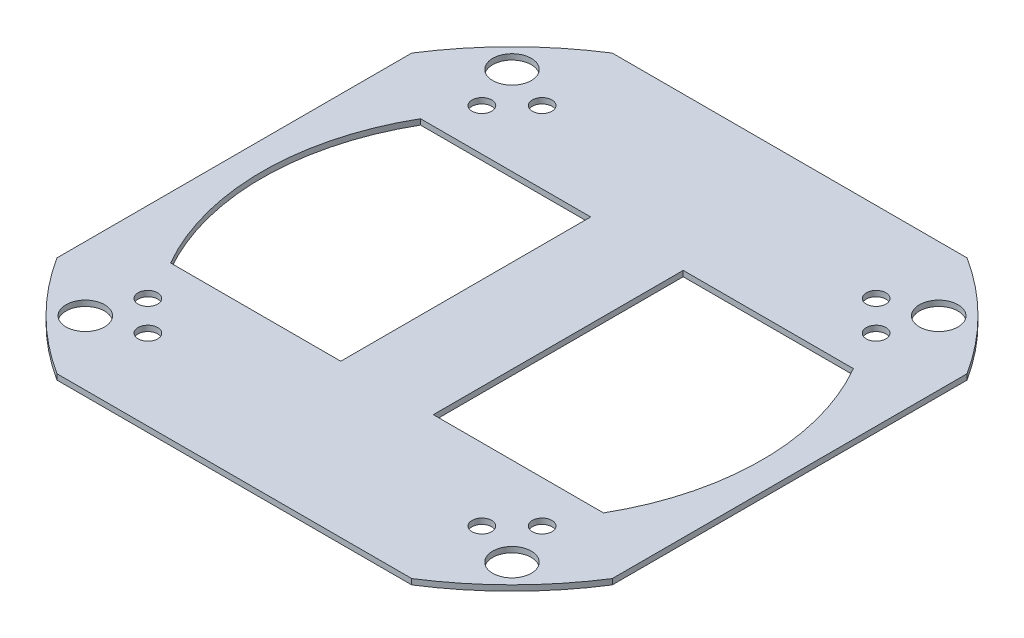
ISO-10303-21;
HEADER;
FILE_DESCRIPTION(('STEP AP214'),'2;1');
FILE_NAME('part.step','',(''),(''),'','','');
FILE_SCHEMA(('AUTOMOTIVE_DESIGN { 1 0 10303 214 1 1 1 1 }'));
ENDSEC;
DATA;
#1=APPLICATION_CONTEXT('core data for automotive mechanical design processes');
#2=APPLICATION_PROTOCOL_DEFINITION('international standard','automotive_design',2000,#1);
#3=PRODUCT_CONTEXT('',#1,'mechanical');
#4=PRODUCT('Part','Part','',(#3));
#5=PRODUCT_RELATED_PRODUCT_CATEGORY('part','',(#4));
#6=PRODUCT_DEFINITION_FORMATION('','',#4);
#7=PRODUCT_DEFINITION_CONTEXT('part definition',#1,'design');
#8=PRODUCT_DEFINITION('design','',#6,#7);
#9=PRODUCT_DEFINITION_SHAPE('','',#8);
#10=(LENGTH_UNIT() NAMED_UNIT(*) SI_UNIT(.MILLI.,.METRE.));
#11=(NAMED_UNIT(*) PLANE_ANGLE_UNIT() SI_UNIT($,.RADIAN.));
#12=(NAMED_UNIT(*) SI_UNIT($,.STERADIAN.) SOLID_ANGLE_UNIT());
#13=UNCERTAINTY_MEASURE_WITH_UNIT(LENGTH_MEASURE(1.E-05),#10,'distance_accuracy_value','');
#14=(GEOMETRIC_REPRESENTATION_CONTEXT(3) GLOBAL_UNCERTAINTY_ASSIGNED_CONTEXT((#13)) GLOBAL_UNIT_ASSIGNED_CONTEXT((#10,
#11,#12)) REPRESENTATION_CONTEXT('',''));
#15=CARTESIAN_POINT('',(0.,0.,0.));
#16=DIRECTION('',(0.,0.,1.));
#17=DIRECTION('',(1.,0.,0.));
#18=AXIS2_PLACEMENT_3D('',#15,#16,#17);
#19=CARTESIAN_POINT('',(0.,3.,0.));
#20=DIRECTION('',(0.,-1.,0.));
#21=DIRECTION('',(0.,0.,-1.));
#22=AXIS2_PLACEMENT_3D('',#19,#20,#21);
#23=CYLINDRICAL_SURFACE('',#22,178.);
#24=CARTESIAN_POINT('',(0.,3.,0.));
#25=DIRECTION('',(0.,1.,0.));
#26=DIRECTION('',(0.,0.,1.));
#27=AXIS2_PLACEMENT_3D('',#24,#25,#26);
#28=CIRCLE('',#27,178.);
#29=CARTESIAN_POINT('',(150.,3.,-95.8331884056875));
#30=VERTEX_POINT('',#29);
#31=CARTESIAN_POINT('',(95.8331884056876,3.,-150.));
#32=VERTEX_POINT('',#31);
#33=EDGE_CURVE('E165',#30,#32,#28,.T.);
#34=ORIENTED_EDGE('',*,*,#33,.F.);
#35=DIRECTION('',(0.,-1.,0.));
#36=VECTOR('',#35,1.);
#37=CARTESIAN_POINT('',(150.,3.,-95.8331884056875));
#38=LINE('',#37,#36);
#39=CARTESIAN_POINT('',(150.,0.,-95.8331884056875));
#40=VERTEX_POINT('',#39);
#41=EDGE_CURVE('E11',#30,#40,#38,.T.);
#42=ORIENTED_EDGE('',*,*,#41,.T.);
#43=CARTESIAN_POINT('',(0.,0.,0.));
#44=DIRECTION('',(0.,1.,0.));
#45=DIRECTION('',(0.,0.,1.));
#46=AXIS2_PLACEMENT_3D('',#43,#44,#45);
#47=CIRCLE('',#46,178.);
#48=CARTESIAN_POINT('',(95.8331884056876,0.,-150.));
#49=VERTEX_POINT('',#48);
#50=EDGE_CURVE('E185',#40,#49,#47,.T.);
#51=ORIENTED_EDGE('',*,*,#50,.T.);
#52=DIRECTION('',(0.,-1.,0.));
#53=VECTOR('',#52,1.);
#54=CARTESIAN_POINT('',(95.8331884056875,3.,-150.));
#55=LINE('',#54,#53);
#56=EDGE_CURVE('E172',#49,#32,#55,.F.);
#57=ORIENTED_EDGE('',*,*,#56,.T.);
#58=EDGE_LOOP('',(#34,#42,#51,#57));
#59=FACE_BOUND('',#58,.T.);
#60=ADVANCED_FACE('F38',(#59),#23,.T.);
#61=CARTESIAN_POINT('',(-95.8331884056876,3.,-150.));
#62=VERTEX_POINT('',#61);
#63=CARTESIAN_POINT('',(-150.,3.,-95.8331884056876));
#64=VERTEX_POINT('',#63);
#65=EDGE_CURVE('E173',#62,#64,#28,.T.);
#66=ORIENTED_EDGE('',*,*,#65,.F.);
#67=DIRECTION('',(0.,-1.,0.));
#68=VECTOR('',#67,1.);
#69=CARTESIAN_POINT('',(-95.8331884056875,3.,-150.));
#70=LINE('',#69,#68);
#71=CARTESIAN_POINT('',(-95.8331884056876,0.,-150.));
#72=VERTEX_POINT('',#71);
#73=EDGE_CURVE('E235',#62,#72,#70,.T.);
#74=ORIENTED_EDGE('',*,*,#73,.T.);
#75=CARTESIAN_POINT('',(-150.,0.,-95.8331884056877));
#76=VERTEX_POINT('',#75);
#77=EDGE_CURVE('E347',#72,#76,#47,.T.);
#78=ORIENTED_EDGE('',*,*,#77,.T.);
#79=DIRECTION('',(0.,-1.,0.));
#80=VECTOR('',#79,1.);
#81=CARTESIAN_POINT('',(-150.,3.,-95.8331884056875));
#82=LINE('',#81,#80);
#83=EDGE_CURVE('E175',#76,#64,#82,.F.);
#84=ORIENTED_EDGE('',*,*,#83,.T.);
#85=EDGE_LOOP('',(#66,#74,#78,#84));
#86=FACE_BOUND('',#85,.T.);
#87=ADVANCED_FACE('F354',(#86),#23,.T.);
#88=CARTESIAN_POINT('',(95.8331884056876,0.,150.));
#89=VERTEX_POINT('',#88);
#90=CARTESIAN_POINT('',(150.,0.,95.8331884056875));
#91=VERTEX_POINT('',#90);
#92=EDGE_CURVE('E182',#89,#91,#47,.T.);
#93=ORIENTED_EDGE('',*,*,#92,.T.);
#94=DIRECTION('',(0.,-1.,0.));
#95=VECTOR('',#94,1.);
#96=CARTESIAN_POINT('',(150.,3.,95.8331884056875));
#97=LINE('',#96,#95);
#98=CARTESIAN_POINT('',(150.,3.,95.8331884056876));
#99=VERTEX_POINT('',#98);
#100=EDGE_CURVE('E46',#91,#99,#97,.F.);
#101=ORIENTED_EDGE('',*,*,#100,.T.);
#102=CARTESIAN_POINT('',(95.8331884056876,3.,150.));
#103=VERTEX_POINT('',#102);
#104=EDGE_CURVE('E167',#103,#99,#28,.T.);
#105=ORIENTED_EDGE('',*,*,#104,.F.);
#106=DIRECTION('',(0.,-1.,0.));
#107=VECTOR('',#106,1.);
#108=CARTESIAN_POINT('',(95.8331884056875,3.,150.));
#109=LINE('',#108,#107);
#110=EDGE_CURVE('E231',#103,#89,#109,.T.);
#111=ORIENTED_EDGE('',*,*,#110,.T.);
#112=EDGE_LOOP('',(#93,#101,#105,#111));
#113=FACE_BOUND('',#112,.T.);
#114=ADVANCED_FACE('F238',(#113),#23,.T.);
#115=CARTESIAN_POINT('',(0.,3.,0.));
#116=DIRECTION('',(0.,1.,0.));
#117=DIRECTION('',(0.,0.,1.));
#118=AXIS2_PLACEMENT_3D('',#115,#116,#117);
#119=PLANE('',#118);
#120=DIRECTION('',(0.,0.,1.));
#121=VECTOR('',#120,1.);
#122=CARTESIAN_POINT('',(150.,3.,-95.8331884056875));
#123=LINE('',#122,#121);
#124=EDGE_CURVE('E151',#30,#99,#123,.T.);
#125=ORIENTED_EDGE('',*,*,#124,.F.);
#126=ORIENTED_EDGE('',*,*,#33,.T.);
#127=DIRECTION('',(1.,0.,0.));
#128=VECTOR('',#127,1.);
#129=CARTESIAN_POINT('',(95.8331884056876,3.,-150.));
#130=LINE('',#129,#128);
#131=EDGE_CURVE('E169',#62,#32,#130,.T.);
#132=ORIENTED_EDGE('',*,*,#131,.F.);
#133=ORIENTED_EDGE('',*,*,#65,.T.);
#134=DIRECTION('',(0.,0.,-1.));
#135=VECTOR('',#134,1.);
#136=CARTESIAN_POINT('',(-150.,3.,0.));
#137=LINE('',#136,#135);
#138=CARTESIAN_POINT('',(-150.,3.,95.8331884056875));
#139=VERTEX_POINT('',#138);
#140=EDGE_CURVE('E61',#139,#64,#137,.T.);
#141=ORIENTED_EDGE('',*,*,#140,.F.);
#142=CARTESIAN_POINT('',(-95.8331884056876,3.,150.));
#143=VERTEX_POINT('',#142);
#144=EDGE_CURVE('E176',#139,#143,#28,.T.);
#145=ORIENTED_EDGE('',*,*,#144,.T.);
#146=DIRECTION('',(-1.,0.,0.));
#147=VECTOR('',#146,1.);
#148=CARTESIAN_POINT('',(0.,3.,150.));
#149=LINE('',#148,#147);
#150=EDGE_CURVE('E53',#103,#143,#149,.T.);
#151=ORIENTED_EDGE('',*,*,#150,.F.);
#152=ORIENTED_EDGE('',*,*,#104,.T.);
#153=EDGE_LOOP('',(#125,#126,#132,#133,#141,#145,#151,#152));
#154=FACE_BOUND('',#153,.T.);
#155=CARTESIAN_POINT('',(90.2169257844611,3.,-106.480381751763));
#156=DIRECTION('',(0.,1.,0.));
#157=DIRECTION('',(0.,0.,1.));
#158=AXIS2_PLACEMENT_3D('',#155,#156,#157);
#159=CIRCLE('',#158,5.30000000000001);
#160=CARTESIAN_POINT('',(90.2169257844611,3.,-101.180381751763));
#161=VERTEX_POINT('',#160);
#162=EDGE_CURVE('E258',#161,#161,#159,.T.);
#163=ORIENTED_EDGE('',*,*,#162,.F.);
#164=EDGE_LOOP('',(#163));
#165=FACE_BOUND('',#164,.T.);
#166=CARTESIAN_POINT('',(-90.216925784473,3.,-106.480381751751));
#167=DIRECTION('',(0.,1.,0.));
#168=DIRECTION('',(0.,0.,-1.));
#169=AXIS2_PLACEMENT_3D('',#166,#167,#168);
#170=CIRCLE('',#169,5.30000000000001);
#171=CARTESIAN_POINT('',(-90.216925784473,3.,-111.780381751751));
#172=VERTEX_POINT('',#171);
#173=EDGE_CURVE('E268',#172,#172,#170,.T.);
#174=ORIENTED_EDGE('',*,*,#173,.F.);
#175=EDGE_LOOP('',(#174));
#176=FACE_BOUND('',#175,.T.);
#177=CARTESIAN_POINT('',(-106.480381751764,3.,-90.2169257844607));
#178=DIRECTION('',(0.,1.,0.));
#179=DIRECTION('',(0.,0.,1.));
#180=AXIS2_PLACEMENT_3D('',#177,#178,#179);
#181=CIRCLE('',#180,5.30000000000001);
#182=CARTESIAN_POINT('',(-106.480381751764,3.,-84.9169257844607));
#183=VERTEX_POINT('',#182);
#184=EDGE_CURVE('E265',#183,#183,#181,.T.);
#185=ORIENTED_EDGE('',*,*,#184,.F.);
#186=EDGE_LOOP('',(#185));
#187=FACE_BOUND('',#186,.T.);
#188=CARTESIAN_POINT('',(-106.480381751751,3.,90.2169257844734));
#189=DIRECTION('',(0.,1.,0.));
#190=DIRECTION('',(0.,0.,-1.));
#191=AXIS2_PLACEMENT_3D('',#188,#189,#190);
#192=CIRCLE('',#191,5.30000000000001);
#193=CARTESIAN_POINT('',(-106.480381751751,3.,84.9169257844734));
#194=VERTEX_POINT('',#193);
#195=EDGE_CURVE('E261',#194,#194,#192,.T.);
#196=ORIENTED_EDGE('',*,*,#195,.F.);
#197=EDGE_LOOP('',(#196));
#198=FACE_BOUND('',#197,.T.);
#199=CARTESIAN_POINT('',(115.258405333413,3.,115.258405333407));
#200=DIRECTION('',(0.,1.,0.));
#201=DIRECTION('',(0.,0.,1.));
#202=AXIS2_PLACEMENT_3D('',#199,#200,#201);
#203=CIRCLE('',#202,10.4140000000044);
#204=CARTESIAN_POINT('',(115.258405333413,3.,125.672405333412));
#205=VERTEX_POINT('',#204);
#206=EDGE_CURVE('E279',#205,#205,#203,.T.);
#207=ORIENTED_EDGE('',*,*,#206,.F.);
#208=EDGE_LOOP('',(#207));
#209=FACE_BOUND('',#208,.T.);
#210=CARTESIAN_POINT('',(-115.258405333401,3.,115.258405333413));
#211=DIRECTION('',(0.,1.,0.));
#212=DIRECTION('',(0.,0.,1.));
#213=AXIS2_PLACEMENT_3D('',#210,#211,#212);
#214=CIRCLE('',#213,10.4140000000044);
#215=CARTESIAN_POINT('',(-115.258405333401,3.,125.672405333418));
#216=VERTEX_POINT('',#215);
#217=EDGE_CURVE('E276',#216,#216,#214,.T.);
#218=ORIENTED_EDGE('',*,*,#217,.F.);
#219=EDGE_LOOP('',(#218));
#220=FACE_BOUND('',#219,.T.);
#221=CARTESIAN_POINT('',(-115.258405333407,3.,-115.258405333401));
#222=DIRECTION('',(0.,1.,0.));
#223=DIRECTION('',(0.,0.,1.));
#224=AXIS2_PLACEMENT_3D('',#221,#222,#223);
#225=CIRCLE('',#224,10.4140000000044);
#226=CARTESIAN_POINT('',(-115.258405333407,3.,-104.844405333397));
#227=VERTEX_POINT('',#226);
#228=EDGE_CURVE('E273',#227,#227,#225,.T.);
#229=ORIENTED_EDGE('',*,*,#228,.F.);
#230=EDGE_LOOP('',(#229));
#231=FACE_BOUND('',#230,.T.);
#232=CARTESIAN_POINT('',(-90.2169257844604,3.,106.480381751764));
#233=DIRECTION('',(0.,1.,0.));
#234=DIRECTION('',(0.,0.,1.));
#235=AXIS2_PLACEMENT_3D('',#232,#233,#234);
#236=CIRCLE('',#235,5.3);
#237=CARTESIAN_POINT('',(-90.2169257844604,3.,111.780381751764));
#238=VERTEX_POINT('',#237);
#239=EDGE_CURVE('E264',#238,#238,#236,.T.);
#240=ORIENTED_EDGE('',*,*,#239,.F.);
#241=EDGE_LOOP('',(#240));
#242=FACE_BOUND('',#241,.T.);
#243=CARTESIAN_POINT('',(106.480381751752,3.,-90.2169257844727));
#244=DIRECTION('',(0.,1.,0.));
#245=DIRECTION('',(0.,0.,-1.));
#246=AXIS2_PLACEMENT_3D('',#243,#244,#245);
#247=CIRCLE('',#246,5.30000000000001);
#248=CARTESIAN_POINT('',(106.480381751752,3.,-95.5169257844727));
#249=VERTEX_POINT('',#248);
#250=EDGE_CURVE('E255',#249,#249,#247,.T.);
#251=ORIENTED_EDGE('',*,*,#250,.F.);
#252=EDGE_LOOP('',(#251));
#253=FACE_BOUND('',#252,.T.);
#254=CARTESIAN_POINT('',(106.480381751763,3.,90.2169257844615));
#255=DIRECTION('',(0.,1.,0.));
#256=DIRECTION('',(0.,0.,1.));
#257=AXIS2_PLACEMENT_3D('',#254,#255,#256);
#258=CIRCLE('',#257,5.3);
#259=CARTESIAN_POINT('',(106.480381751763,3.,95.5169257844615));
#260=VERTEX_POINT('',#259);
#261=EDGE_CURVE('E249',#260,#260,#258,.T.);
#262=ORIENTED_EDGE('',*,*,#261,.F.);
#263=EDGE_LOOP('',(#262));
#264=FACE_BOUND('',#263,.T.);
#265=CARTESIAN_POINT('',(90.2169257844723,3.,106.480381751752));
#266=DIRECTION('',(0.,1.,0.));
#267=DIRECTION('',(0.,0.,-1.));
#268=AXIS2_PLACEMENT_3D('',#265,#266,#267);
#269=CIRCLE('',#268,5.30000000000002);
#270=CARTESIAN_POINT('',(90.2169257844723,3.,101.180381751752));
#271=VERTEX_POINT('',#270);
#272=EDGE_CURVE('E245',#271,#271,#269,.T.);
#273=ORIENTED_EDGE('',*,*,#272,.F.);
#274=EDGE_LOOP('',(#273));
#275=FACE_BOUND('',#274,.T.);
#276=CARTESIAN_POINT('',(115.258405333407,3.,-115.258405333407));
#277=DIRECTION('',(0.,1.,0.));
#278=DIRECTION('',(0.,0.,1.));
#279=AXIS2_PLACEMENT_3D('',#276,#277,#278);
#280=CIRCLE('',#279,10.4140000000044);
#281=CARTESIAN_POINT('',(115.258405333407,3.,-104.844405333403));
#282=VERTEX_POINT('',#281);
#283=EDGE_CURVE('E191',#282,#282,#280,.T.);
#284=ORIENTED_EDGE('',*,*,#283,.F.);
#285=EDGE_LOOP('',(#284));
#286=FACE_BOUND('',#285,.T.);
#287=CARTESIAN_POINT('',(0.,3.,0.));
#288=DIRECTION('',(0.,1.,0.));
#289=DIRECTION('',(0.,0.,1.));
#290=AXIS2_PLACEMENT_3D('',#287,#288,#289);
#291=CIRCLE('',#290,135.);
#292=CARTESIAN_POINT('',(-116.913429510899,3.,-67.5000000000001));
#293=VERTEX_POINT('',#292);
#294=CARTESIAN_POINT('',(-116.913429510899,3.,67.5));
#295=VERTEX_POINT('',#294);
#296=EDGE_CURVE('E320',#293,#295,#291,.T.);
#297=ORIENTED_EDGE('',*,*,#296,.F.);
#298=DIRECTION('',(-1.,0.,0.));
#299=VECTOR('',#298,1.);
#300=CARTESIAN_POINT('',(-25.,3.,-67.5));
#301=LINE('',#300,#299);
#302=CARTESIAN_POINT('',(-25.,3.,-67.5));
#303=VERTEX_POINT('',#302);
#304=EDGE_CURVE('E317',#303,#293,#301,.T.);
#305=ORIENTED_EDGE('',*,*,#304,.F.);
#306=DIRECTION('',(0.,0.,-1.));
#307=VECTOR('',#306,1.);
#308=CARTESIAN_POINT('',(-25.,3.,-33.75));
#309=LINE('',#308,#307);
#310=CARTESIAN_POINT('',(-25.,3.,67.5));
#311=VERTEX_POINT('',#310);
#312=EDGE_CURVE('E315',#311,#303,#309,.T.);
#313=ORIENTED_EDGE('',*,*,#312,.F.);
#314=DIRECTION('',(1.,0.,0.));
#315=VECTOR('',#314,1.);
#316=CARTESIAN_POINT('',(-25.,3.,67.5));
#317=LINE('',#316,#315);
#318=EDGE_CURVE('E322',#295,#311,#317,.T.);
#319=ORIENTED_EDGE('',*,*,#318,.F.);
#320=EDGE_LOOP('',(#297,#305,#313,#319));
#321=FACE_BOUND('',#320,.T.);
#322=CARTESIAN_POINT('',(0.,3.,0.));
#323=DIRECTION('',(0.,1.,0.));
#324=DIRECTION('',(0.,0.,1.));
#325=AXIS2_PLACEMENT_3D('',#322,#323,#324);
#326=CIRCLE('',#325,135.);
#327=CARTESIAN_POINT('',(116.913429510899,3.,67.5));
#328=VERTEX_POINT('',#327);
#329=CARTESIAN_POINT('',(116.913429510899,3.,-67.5));
#330=VERTEX_POINT('',#329);
#331=EDGE_CURVE('E291',#328,#330,#326,.T.);
#332=ORIENTED_EDGE('',*,*,#331,.F.);
#333=DIRECTION('',(1.,0.,0.));
#334=VECTOR('',#333,1.);
#335=CARTESIAN_POINT('',(25.,3.,67.5));
#336=LINE('',#335,#334);
#337=CARTESIAN_POINT('',(25.,3.,67.5));
#338=VERTEX_POINT('',#337);
#339=EDGE_CURVE('E288',#338,#328,#336,.T.);
#340=ORIENTED_EDGE('',*,*,#339,.F.);
#341=DIRECTION('',(0.,0.,1.));
#342=VECTOR('',#341,1.);
#343=CARTESIAN_POINT('',(25.,3.,-33.75));
#344=LINE('',#343,#342);
#345=CARTESIAN_POINT('',(25.,3.,-67.5));
#346=VERTEX_POINT('',#345);
#347=EDGE_CURVE('E286',#346,#338,#344,.T.);
#348=ORIENTED_EDGE('',*,*,#347,.F.);
#349=DIRECTION('',(-1.,0.,0.));
#350=VECTOR('',#349,1.);
#351=CARTESIAN_POINT('',(25.,3.,-67.5));
#352=LINE('',#351,#350);
#353=EDGE_CURVE('E293',#330,#346,#352,.T.);
#354=ORIENTED_EDGE('',*,*,#353,.F.);
#355=EDGE_LOOP('',(#332,#340,#348,#354));
#356=FACE_BOUND('',#355,.T.);
#357=ADVANCED_FACE('F162',(#154,#165,#176,#187,#198,#209,#220,#231,#242,#253,#264,#275,#286,
#321,#356),#119,.T.);
#358=CARTESIAN_POINT('',(0.,0.,0.));
#359=DIRECTION('',(0.,1.,0.));
#360=DIRECTION('',(0.,0.,1.));
#361=AXIS2_PLACEMENT_3D('',#358,#359,#360);
#362=PLANE('',#361);
#363=CARTESIAN_POINT('',(90.2169257844611,0.,-106.480381751763));
#364=DIRECTION('',(0.,1.,0.));
#365=DIRECTION('',(0.,0.,1.));
#366=AXIS2_PLACEMENT_3D('',#363,#364,#365);
#367=CIRCLE('',#366,5.30000000000001);
#368=CARTESIAN_POINT('',(90.2169257844611,0.,-101.180381751763));
#369=VERTEX_POINT('',#368);
#370=EDGE_CURVE('E221',#369,#369,#367,.T.);
#371=ORIENTED_EDGE('',*,*,#370,.T.);
#372=EDGE_LOOP('',(#371));
#373=FACE_BOUND('',#372,.T.);
#374=CARTESIAN_POINT('',(-90.216925784473,0.,-106.480381751751));
#375=DIRECTION('',(0.,1.,0.));
#376=DIRECTION('',(0.,0.,1.));
#377=AXIS2_PLACEMENT_3D('',#374,#375,#376);
#378=CIRCLE('',#377,5.30000000000001);
#379=CARTESIAN_POINT('',(-90.216925784473,0.,-101.180381751751));
#380=VERTEX_POINT('',#379);
#381=EDGE_CURVE('E218',#380,#380,#378,.T.);
#382=ORIENTED_EDGE('',*,*,#381,.T.);
#383=EDGE_LOOP('',(#382));
#384=FACE_BOUND('',#383,.T.);
#385=CARTESIAN_POINT('',(-106.480381751764,0.,-90.2169257844607));
#386=DIRECTION('',(0.,1.,0.));
#387=DIRECTION('',(0.,0.,1.));
#388=AXIS2_PLACEMENT_3D('',#385,#386,#387);
#389=CIRCLE('',#388,5.30000000000001);
#390=CARTESIAN_POINT('',(-106.480381751764,0.,-84.9169257844607));
#391=VERTEX_POINT('',#390);
#392=EDGE_CURVE('E215',#391,#391,#389,.T.);
#393=ORIENTED_EDGE('',*,*,#392,.T.);
#394=EDGE_LOOP('',(#393));
#395=FACE_BOUND('',#394,.T.);
#396=CARTESIAN_POINT('',(-106.480381751751,0.,90.2169257844734));
#397=DIRECTION('',(0.,1.,0.));
#398=DIRECTION('',(0.,0.,1.));
#399=AXIS2_PLACEMENT_3D('',#396,#397,#398);
#400=CIRCLE('',#399,5.30000000000001);
#401=CARTESIAN_POINT('',(-106.480381751751,0.,95.5169257844734));
#402=VERTEX_POINT('',#401);
#403=EDGE_CURVE('E212',#402,#402,#400,.T.);
#404=ORIENTED_EDGE('',*,*,#403,.T.);
#405=EDGE_LOOP('',(#404));
#406=FACE_BOUND('',#405,.T.);
#407=CARTESIAN_POINT('',(115.258405333413,0.,115.258405333407));
#408=DIRECTION('',(0.,1.,0.));
#409=DIRECTION('',(0.,0.,1.));
#410=AXIS2_PLACEMENT_3D('',#407,#408,#409);
#411=CIRCLE('',#410,10.4140000000044);
#412=CARTESIAN_POINT('',(115.258405333413,0.,125.672405333412));
#413=VERTEX_POINT('',#412);
#414=EDGE_CURVE('E209',#413,#413,#411,.T.);
#415=ORIENTED_EDGE('',*,*,#414,.T.);
#416=EDGE_LOOP('',(#415));
#417=FACE_BOUND('',#416,.T.);
#418=CARTESIAN_POINT('',(-115.258405333401,0.,115.258405333413));
#419=DIRECTION('',(0.,1.,0.));
#420=DIRECTION('',(0.,0.,1.));
#421=AXIS2_PLACEMENT_3D('',#418,#419,#420);
#422=CIRCLE('',#421,10.4140000000044);
#423=CARTESIAN_POINT('',(-115.258405333401,0.,125.672405333418));
#424=VERTEX_POINT('',#423);
#425=EDGE_CURVE('E206',#424,#424,#422,.T.);
#426=ORIENTED_EDGE('',*,*,#425,.T.);
#427=EDGE_LOOP('',(#426));
#428=FACE_BOUND('',#427,.T.);
#429=CARTESIAN_POINT('',(-115.258405333407,0.,-115.258405333401));
#430=DIRECTION('',(0.,1.,0.));
#431=DIRECTION('',(0.,0.,1.));
#432=AXIS2_PLACEMENT_3D('',#429,#430,#431);
#433=CIRCLE('',#432,10.4140000000044);
#434=CARTESIAN_POINT('',(-115.258405333407,0.,-104.844405333397));
#435=VERTEX_POINT('',#434);
#436=EDGE_CURVE('E203',#435,#435,#433,.T.);
#437=ORIENTED_EDGE('',*,*,#436,.T.);
#438=EDGE_LOOP('',(#437));
#439=FACE_BOUND('',#438,.T.);
#440=CARTESIAN_POINT('',(-90.2169257844604,0.,106.480381751764));
#441=DIRECTION('',(0.,1.,0.));
#442=DIRECTION('',(0.,0.,1.));
#443=AXIS2_PLACEMENT_3D('',#440,#441,#442);
#444=CIRCLE('',#443,5.3);
#445=CARTESIAN_POINT('',(-90.2169257844604,0.,111.780381751764));
#446=VERTEX_POINT('',#445);
#447=EDGE_CURVE('E200',#446,#446,#444,.T.);
#448=ORIENTED_EDGE('',*,*,#447,.T.);
#449=EDGE_LOOP('',(#448));
#450=FACE_BOUND('',#449,.T.);
#451=CARTESIAN_POINT('',(106.480381751752,0.,-90.2169257844727));
#452=DIRECTION('',(0.,1.,0.));
#453=DIRECTION('',(0.,0.,1.));
#454=AXIS2_PLACEMENT_3D('',#451,#452,#453);
#455=CIRCLE('',#454,5.30000000000001);
#456=CARTESIAN_POINT('',(106.480381751752,0.,-84.9169257844726));
#457=VERTEX_POINT('',#456);
#458=EDGE_CURVE('E197',#457,#457,#455,.T.);
#459=ORIENTED_EDGE('',*,*,#458,.T.);
#460=EDGE_LOOP('',(#459));
#461=FACE_BOUND('',#460,.T.);
#462=CARTESIAN_POINT('',(106.480381751763,0.,90.2169257844615));
#463=DIRECTION('',(0.,1.,0.));
#464=DIRECTION('',(0.,0.,1.));
#465=AXIS2_PLACEMENT_3D('',#462,#463,#464);
#466=CIRCLE('',#465,5.3);
#467=CARTESIAN_POINT('',(106.480381751763,0.,95.5169257844615));
#468=VERTEX_POINT('',#467);
#469=EDGE_CURVE('E194',#468,#468,#466,.T.);
#470=ORIENTED_EDGE('',*,*,#469,.T.);
#471=EDGE_LOOP('',(#470));
#472=FACE_BOUND('',#471,.T.);
#473=CARTESIAN_POINT('',(90.2169257844723,0.,106.480381751752));
#474=DIRECTION('',(0.,1.,0.));
#475=DIRECTION('',(0.,0.,1.));
#476=AXIS2_PLACEMENT_3D('',#473,#474,#475);
#477=CIRCLE('',#476,5.30000000000002);
#478=CARTESIAN_POINT('',(90.2169257844723,0.,111.780381751752));
#479=VERTEX_POINT('',#478);
#480=EDGE_CURVE('E190',#479,#479,#477,.T.);
#481=ORIENTED_EDGE('',*,*,#480,.T.);
#482=EDGE_LOOP('',(#481));
#483=FACE_BOUND('',#482,.T.);
#484=CARTESIAN_POINT('',(115.258405333407,0.,-115.258405333407));
#485=DIRECTION('',(0.,1.,0.));
#486=DIRECTION('',(0.,0.,1.));
#487=AXIS2_PLACEMENT_3D('',#484,#485,#486);
#488=CIRCLE('',#487,10.4140000000044);
#489=CARTESIAN_POINT('',(115.258405333407,0.,-104.844405333403));
#490=VERTEX_POINT('',#489);
#491=EDGE_CURVE('E187',#490,#490,#488,.T.);
#492=ORIENTED_EDGE('',*,*,#491,.T.);
#493=EDGE_LOOP('',(#492));
#494=FACE_BOUND('',#493,.T.);
#495=DIRECTION('',(-1.,0.,0.));
#496=VECTOR('',#495,1.);
#497=CARTESIAN_POINT('',(-25.,0.,-67.5));
#498=LINE('',#497,#496);
#499=CARTESIAN_POINT('',(-25.,0.,-67.5));
#500=VERTEX_POINT('',#499);
#501=CARTESIAN_POINT('',(-116.913429510899,0.,-67.5000000000001));
#502=VERTEX_POINT('',#501);
#503=EDGE_CURVE('E314',#500,#502,#498,.T.);
#504=ORIENTED_EDGE('',*,*,#503,.T.);
#505=CARTESIAN_POINT('',(0.,0.,0.));
#506=DIRECTION('',(0.,1.,0.));
#507=DIRECTION('',(0.,0.,1.));
#508=AXIS2_PLACEMENT_3D('',#505,#506,#507);
#509=CIRCLE('',#508,135.);
#510=CARTESIAN_POINT('',(-116.913429510899,0.,67.5));
#511=VERTEX_POINT('',#510);
#512=EDGE_CURVE('E328',#502,#511,#509,.T.);
#513=ORIENTED_EDGE('',*,*,#512,.T.);
#514=DIRECTION('',(1.,0.,0.));
#515=VECTOR('',#514,1.);
#516=CARTESIAN_POINT('',(-25.,0.,67.5));
#517=LINE('',#516,#515);
#518=CARTESIAN_POINT('',(-25.,0.,67.5));
#519=VERTEX_POINT('',#518);
#520=EDGE_CURVE('E331',#511,#519,#517,.T.);
#521=ORIENTED_EDGE('',*,*,#520,.T.);
#522=DIRECTION('',(0.,0.,-1.));
#523=VECTOR('',#522,1.);
#524=CARTESIAN_POINT('',(-25.,0.,-33.75));
#525=LINE('',#524,#523);
#526=EDGE_CURVE('E318',#519,#500,#525,.T.);
#527=ORIENTED_EDGE('',*,*,#526,.T.);
#528=EDGE_LOOP('',(#504,#513,#521,#527));
#529=FACE_BOUND('',#528,.T.);
#530=ORIENTED_EDGE('',*,*,#50,.F.);
#531=DIRECTION('',(0.,0.,1.));
#532=VECTOR('',#531,1.);
#533=CARTESIAN_POINT('',(150.,0.,0.));
#534=LINE('',#533,#532);
#535=EDGE_CURVE('E154',#40,#91,#534,.T.);
#536=ORIENTED_EDGE('',*,*,#535,.T.);
#537=ORIENTED_EDGE('',*,*,#92,.F.);
#538=DIRECTION('',(-1.,0.,0.));
#539=VECTOR('',#538,1.);
#540=CARTESIAN_POINT('',(0.,0.,150.));
#541=LINE('',#540,#539);
#542=CARTESIAN_POINT('',(-95.8331884056876,0.,150.));
#543=VERTEX_POINT('',#542);
#544=EDGE_CURVE('E251',#89,#543,#541,.T.);
#545=ORIENTED_EDGE('',*,*,#544,.T.);
#546=CARTESIAN_POINT('',(-150.,0.,95.8331884056875));
#547=VERTEX_POINT('',#546);
#548=EDGE_CURVE('E186',#547,#543,#47,.T.);
#549=ORIENTED_EDGE('',*,*,#548,.F.);
#550=DIRECTION('',(0.,0.,-1.));
#551=VECTOR('',#550,1.);
#552=CARTESIAN_POINT('',(-150.,0.,0.));
#553=LINE('',#552,#551);
#554=EDGE_CURVE('E168',#547,#76,#553,.T.);
#555=ORIENTED_EDGE('',*,*,#554,.T.);
#556=ORIENTED_EDGE('',*,*,#77,.F.);
#557=DIRECTION('',(1.,0.,0.));
#558=VECTOR('',#557,1.);
#559=CARTESIAN_POINT('',(0.,0.,-150.));
#560=LINE('',#559,#558);
#561=EDGE_CURVE('E246',#72,#49,#560,.T.);
#562=ORIENTED_EDGE('',*,*,#561,.T.);
#563=EDGE_LOOP('',(#530,#536,#537,#545,#549,#555,#556,#562));
#564=FACE_BOUND('',#563,.T.);
#565=DIRECTION('',(1.,0.,0.));
#566=VECTOR('',#565,1.);
#567=CARTESIAN_POINT('',(25.,0.,67.5));
#568=LINE('',#567,#566);
#569=CARTESIAN_POINT('',(25.,0.,67.5));
#570=VERTEX_POINT('',#569);
#571=CARTESIAN_POINT('',(116.913429510899,0.,67.5));
#572=VERTEX_POINT('',#571);
#573=EDGE_CURVE('E224',#570,#572,#568,.T.);
#574=ORIENTED_EDGE('',*,*,#573,.T.);
#575=CARTESIAN_POINT('',(0.,0.,0.));
#576=DIRECTION('',(0.,1.,0.));
#577=DIRECTION('',(0.,0.,1.));
#578=AXIS2_PLACEMENT_3D('',#575,#576,#577);
#579=CIRCLE('',#578,135.);
#580=CARTESIAN_POINT('',(116.913429510899,0.,-67.5));
#581=VERTEX_POINT('',#580);
#582=EDGE_CURVE('E299',#572,#581,#579,.T.);
#583=ORIENTED_EDGE('',*,*,#582,.T.);
#584=DIRECTION('',(-1.,0.,0.));
#585=VECTOR('',#584,1.);
#586=CARTESIAN_POINT('',(25.,0.,-67.5));
#587=LINE('',#586,#585);
#588=CARTESIAN_POINT('',(25.,0.,-67.5));
#589=VERTEX_POINT('',#588);
#590=EDGE_CURVE('E302',#581,#589,#587,.T.);
#591=ORIENTED_EDGE('',*,*,#590,.T.);
#592=DIRECTION('',(0.,0.,1.));
#593=VECTOR('',#592,1.);
#594=CARTESIAN_POINT('',(25.,0.,-33.75));
#595=LINE('',#594,#593);
#596=EDGE_CURVE('E289',#589,#570,#595,.T.);
#597=ORIENTED_EDGE('',*,*,#596,.T.);
#598=EDGE_LOOP('',(#574,#583,#591,#597));
#599=FACE_BOUND('',#598,.T.);
#600=ADVANCED_FACE('F241',(#373,#384,#395,#406,#417,#428,#439,#450,#461,#472,#483,#494,#529,
#564,#599),#362,.F.);
#601=ORIENTED_EDGE('',*,*,#548,.T.);
#602=DIRECTION('',(0.,-1.,0.));
#603=VECTOR('',#602,1.);
#604=CARTESIAN_POINT('',(-95.8331884056875,3.,150.));
#605=LINE('',#604,#603);
#606=EDGE_CURVE('E229',#543,#143,#605,.F.);
#607=ORIENTED_EDGE('',*,*,#606,.T.);
#608=ORIENTED_EDGE('',*,*,#144,.F.);
#609=DIRECTION('',(0.,-1.,0.));
#610=VECTOR('',#609,1.);
#611=CARTESIAN_POINT('',(-150.,3.,95.8331884056875));
#612=LINE('',#611,#610);
#613=EDGE_CURVE('E226',#139,#547,#612,.T.);
#614=ORIENTED_EDGE('',*,*,#613,.T.);
#615=EDGE_LOOP('',(#601,#607,#608,#614));
#616=FACE_BOUND('',#615,.T.);
#617=ADVANCED_FACE('F40',(#616),#23,.T.);
#618=CARTESIAN_POINT('',(-25.,3.,-67.5));
#619=DIRECTION('',(0.,0.,1.));
#620=DIRECTION('',(1.,0.,0.));
#621=AXIS2_PLACEMENT_3D('',#618,#619,#620);
#622=PLANE('',#621);
#623=ORIENTED_EDGE('',*,*,#503,.F.);
#624=DIRECTION('',(0.,-1.,0.));
#625=VECTOR('',#624,1.);
#626=CARTESIAN_POINT('',(-25.,3.,-67.5));
#627=LINE('',#626,#625);
#628=EDGE_CURVE('E180',#303,#500,#627,.T.);
#629=ORIENTED_EDGE('',*,*,#628,.F.);
#630=ORIENTED_EDGE('',*,*,#304,.T.);
#631=DIRECTION('',(0.,-1.,0.));
#632=VECTOR('',#631,1.);
#633=CARTESIAN_POINT('',(-116.913429510899,3.,-67.5000000000001));
#634=LINE('',#633,#632);
#635=EDGE_CURVE('E338',#293,#502,#634,.T.);
#636=ORIENTED_EDGE('',*,*,#635,.T.);
#637=EDGE_LOOP('',(#623,#629,#630,#636));
#638=FACE_BOUND('',#637,.T.);
#639=ADVANCED_FACE('F380',(#638),#622,.T.);
#640=CARTESIAN_POINT('',(0.,3.,0.));
#641=DIRECTION('',(0.,-1.,0.));
#642=DIRECTION('',(0.,0.,-1.));
#643=AXIS2_PLACEMENT_3D('',#640,#641,#642);
#644=CYLINDRICAL_SURFACE('',#643,135.);
#645=ORIENTED_EDGE('',*,*,#512,.F.);
#646=ORIENTED_EDGE('',*,*,#635,.F.);
#647=ORIENTED_EDGE('',*,*,#296,.T.);
#648=DIRECTION('',(0.,-1.,0.));
#649=VECTOR('',#648,1.);
#650=CARTESIAN_POINT('',(-116.913429510899,3.,67.5));
#651=LINE('',#650,#649);
#652=EDGE_CURVE('E337',#295,#511,#651,.T.);
#653=ORIENTED_EDGE('',*,*,#652,.T.);
#654=EDGE_LOOP('',(#645,#646,#647,#653));
#655=FACE_BOUND('',#654,.T.);
#656=ADVANCED_FACE('F385',(#655),#644,.F.);
#657=CARTESIAN_POINT('',(-25.,3.,67.5));
#658=DIRECTION('',(0.,0.,-1.));
#659=DIRECTION('',(-1.,0.,0.));
#660=AXIS2_PLACEMENT_3D('',#657,#658,#659);
#661=PLANE('',#660);
#662=ORIENTED_EDGE('',*,*,#520,.F.);
#663=ORIENTED_EDGE('',*,*,#652,.F.);
#664=ORIENTED_EDGE('',*,*,#318,.T.);
#665=DIRECTION('',(0.,-1.,0.));
#666=VECTOR('',#665,1.);
#667=CARTESIAN_POINT('',(-25.,3.,67.5));
#668=LINE('',#667,#666);
#669=EDGE_CURVE('E325',#311,#519,#668,.T.);
#670=ORIENTED_EDGE('',*,*,#669,.T.);
#671=EDGE_LOOP('',(#662,#663,#664,#670));
#672=FACE_BOUND('',#671,.T.);
#673=ADVANCED_FACE('F398',(#672),#661,.T.);
#674=CARTESIAN_POINT('',(-25.,3.,-33.75));
#675=DIRECTION('',(-1.,0.,0.));
#676=DIRECTION('',(0.,0.,1.));
#677=AXIS2_PLACEMENT_3D('',#674,#675,#676);
#678=PLANE('',#677);
#679=ORIENTED_EDGE('',*,*,#526,.F.);
#680=ORIENTED_EDGE('',*,*,#669,.F.);
#681=ORIENTED_EDGE('',*,*,#312,.T.);
#682=ORIENTED_EDGE('',*,*,#628,.T.);
#683=EDGE_LOOP('',(#679,#680,#681,#682));
#684=FACE_BOUND('',#683,.T.);
#685=ADVANCED_FACE('F402',(#684),#678,.T.);
#686=CARTESIAN_POINT('',(25.,3.,67.5));
#687=DIRECTION('',(0.,0.,-1.));
#688=DIRECTION('',(-1.,0.,0.));
#689=AXIS2_PLACEMENT_3D('',#686,#687,#688);
#690=PLANE('',#689);
#691=ORIENTED_EDGE('',*,*,#573,.F.);
#692=DIRECTION('',(0.,-1.,0.));
#693=VECTOR('',#692,1.);
#694=CARTESIAN_POINT('',(25.,3.,67.5));
#695=LINE('',#694,#693);
#696=EDGE_CURVE('E312',#338,#570,#695,.T.);
#697=ORIENTED_EDGE('',*,*,#696,.F.);
#698=ORIENTED_EDGE('',*,*,#339,.T.);
#699=DIRECTION('',(0.,-1.,0.));
#700=VECTOR('',#699,1.);
#701=CARTESIAN_POINT('',(116.913429510899,3.,67.5));
#702=LINE('',#701,#700);
#703=EDGE_CURVE('E310',#328,#572,#702,.T.);
#704=ORIENTED_EDGE('',*,*,#703,.T.);
#705=EDGE_LOOP('',(#691,#697,#698,#704));
#706=FACE_BOUND('',#705,.T.);
#707=ADVANCED_FACE('F406',(#706),#690,.T.);
#708=CARTESIAN_POINT('',(0.,3.,0.));
#709=DIRECTION('',(0.,-1.,0.));
#710=DIRECTION('',(0.,0.,-1.));
#711=AXIS2_PLACEMENT_3D('',#708,#709,#710);
#712=CYLINDRICAL_SURFACE('',#711,135.);
#713=ORIENTED_EDGE('',*,*,#582,.F.);
#714=ORIENTED_EDGE('',*,*,#703,.F.);
#715=ORIENTED_EDGE('',*,*,#331,.T.);
#716=DIRECTION('',(0.,-1.,0.));
#717=VECTOR('',#716,1.);
#718=CARTESIAN_POINT('',(116.913429510899,3.,-67.5));
#719=LINE('',#718,#717);
#720=EDGE_CURVE('E308',#330,#581,#719,.T.);
#721=ORIENTED_EDGE('',*,*,#720,.T.);
#722=EDGE_LOOP('',(#713,#714,#715,#721));
#723=FACE_BOUND('',#722,.T.);
#724=ADVANCED_FACE('F409',(#723),#712,.F.);
#725=CARTESIAN_POINT('',(25.,3.,-67.5));
#726=DIRECTION('',(0.,0.,1.));
#727=DIRECTION('',(1.,0.,0.));
#728=AXIS2_PLACEMENT_3D('',#725,#726,#727);
#729=PLANE('',#728);
#730=ORIENTED_EDGE('',*,*,#590,.F.);
#731=ORIENTED_EDGE('',*,*,#720,.F.);
#732=ORIENTED_EDGE('',*,*,#353,.T.);
#733=DIRECTION('',(0.,-1.,0.));
#734=VECTOR('',#733,1.);
#735=CARTESIAN_POINT('',(25.,3.,-67.5));
#736=LINE('',#735,#734);
#737=EDGE_CURVE('E296',#346,#589,#736,.T.);
#738=ORIENTED_EDGE('',*,*,#737,.T.);
#739=EDGE_LOOP('',(#730,#731,#732,#738));
#740=FACE_BOUND('',#739,.T.);
#741=ADVANCED_FACE('F413',(#740),#729,.T.);
#742=CARTESIAN_POINT('',(25.,3.,-33.75));
#743=DIRECTION('',(1.,0.,0.));
#744=DIRECTION('',(0.,0.,-1.));
#745=AXIS2_PLACEMENT_3D('',#742,#743,#744);
#746=PLANE('',#745);
#747=ORIENTED_EDGE('',*,*,#596,.F.);
#748=ORIENTED_EDGE('',*,*,#737,.F.);
#749=ORIENTED_EDGE('',*,*,#347,.T.);
#750=ORIENTED_EDGE('',*,*,#696,.T.);
#751=EDGE_LOOP('',(#747,#748,#749,#750));
#752=FACE_BOUND('',#751,.T.);
#753=ADVANCED_FACE('F417',(#752),#746,.T.);
#754=CARTESIAN_POINT('',(115.258405333407,-7.,-115.258405333407));
#755=DIRECTION('',(0.,1.,0.));
#756=DIRECTION('',(0.,0.,1.));
#757=AXIS2_PLACEMENT_3D('',#754,#755,#756);
#758=CYLINDRICAL_SURFACE('',#757,10.4140000000044);
#759=ORIENTED_EDGE('',*,*,#283,.T.);
#760=EDGE_LOOP('',(#759));
#761=FACE_BOUND('',#760,.T.);
#762=ORIENTED_EDGE('',*,*,#491,.F.);
#763=EDGE_LOOP('',(#762));
#764=FACE_BOUND('',#763,.T.);
#765=ADVANCED_FACE('F421',(#761,#764),#758,.F.);
#766=CARTESIAN_POINT('',(90.2169257844723,-7.,106.480381751752));
#767=DIRECTION('',(0.,1.,0.));
#768=DIRECTION('',(0.,0.,1.));
#769=AXIS2_PLACEMENT_3D('',#766,#767,#768);
#770=CYLINDRICAL_SURFACE('',#769,5.30000000000002);
#771=ORIENTED_EDGE('',*,*,#272,.T.);
#772=EDGE_LOOP('',(#771));
#773=FACE_BOUND('',#772,.T.);
#774=ORIENTED_EDGE('',*,*,#480,.F.);
#775=EDGE_LOOP('',(#774));
#776=FACE_BOUND('',#775,.T.);
#777=ADVANCED_FACE('F425',(#773,#776),#770,.F.);
#778=CARTESIAN_POINT('',(106.480381751763,-7.,90.2169257844615));
#779=DIRECTION('',(0.,1.,0.));
#780=DIRECTION('',(0.,0.,1.));
#781=AXIS2_PLACEMENT_3D('',#778,#779,#780);
#782=CYLINDRICAL_SURFACE('',#781,5.3);
#783=ORIENTED_EDGE('',*,*,#261,.T.);
#784=EDGE_LOOP('',(#783));
#785=FACE_BOUND('',#784,.T.);
#786=ORIENTED_EDGE('',*,*,#469,.F.);
#787=EDGE_LOOP('',(#786));
#788=FACE_BOUND('',#787,.T.);
#789=ADVANCED_FACE('F461',(#785,#788),#782,.F.);
#790=CARTESIAN_POINT('',(106.480381751752,-7.,-90.2169257844727));
#791=DIRECTION('',(0.,1.,0.));
#792=DIRECTION('',(0.,0.,1.));
#793=AXIS2_PLACEMENT_3D('',#790,#791,#792);
#794=CYLINDRICAL_SURFACE('',#793,5.30000000000001);
#795=ORIENTED_EDGE('',*,*,#250,.T.);
#796=EDGE_LOOP('',(#795));
#797=FACE_BOUND('',#796,.T.);
#798=ORIENTED_EDGE('',*,*,#458,.F.);
#799=EDGE_LOOP('',(#798));
#800=FACE_BOUND('',#799,.T.);
#801=ADVANCED_FACE('F440',(#797,#800),#794,.F.);
#802=CARTESIAN_POINT('',(-90.2169257844604,-7.,106.480381751764));
#803=DIRECTION('',(0.,1.,0.));
#804=DIRECTION('',(0.,0.,1.));
#805=AXIS2_PLACEMENT_3D('',#802,#803,#804);
#806=CYLINDRICAL_SURFACE('',#805,5.3);
#807=ORIENTED_EDGE('',*,*,#239,.T.);
#808=EDGE_LOOP('',(#807));
#809=FACE_BOUND('',#808,.T.);
#810=ORIENTED_EDGE('',*,*,#447,.F.);
#811=EDGE_LOOP('',(#810));
#812=FACE_BOUND('',#811,.T.);
#813=ADVANCED_FACE('F437',(#809,#812),#806,.F.);
#814=CARTESIAN_POINT('',(-115.258405333407,-7.,-115.258405333401));
#815=DIRECTION('',(0.,1.,0.));
#816=DIRECTION('',(0.,0.,1.));
#817=AXIS2_PLACEMENT_3D('',#814,#815,#816);
#818=CYLINDRICAL_SURFACE('',#817,10.4140000000044);
#819=ORIENTED_EDGE('',*,*,#228,.T.);
#820=EDGE_LOOP('',(#819));
#821=FACE_BOUND('',#820,.T.);
#822=ORIENTED_EDGE('',*,*,#436,.F.);
#823=EDGE_LOOP('',(#822));
#824=FACE_BOUND('',#823,.T.);
#825=ADVANCED_FACE('F431',(#821,#824),#818,.F.);
#826=CARTESIAN_POINT('',(-115.258405333401,-7.,115.258405333413));
#827=DIRECTION('',(0.,1.,0.));
#828=DIRECTION('',(0.,0.,1.));
#829=AXIS2_PLACEMENT_3D('',#826,#827,#828);
#830=CYLINDRICAL_SURFACE('',#829,10.4140000000044);
#831=ORIENTED_EDGE('',*,*,#217,.T.);
#832=EDGE_LOOP('',(#831));
#833=FACE_BOUND('',#832,.T.);
#834=ORIENTED_EDGE('',*,*,#425,.F.);
#835=EDGE_LOOP('',(#834));
#836=FACE_BOUND('',#835,.T.);
#837=ADVANCED_FACE('F427',(#833,#836),#830,.F.);
#838=CARTESIAN_POINT('',(115.258405333413,-7.,115.258405333407));
#839=DIRECTION('',(0.,1.,0.));
#840=DIRECTION('',(0.,0.,1.));
#841=AXIS2_PLACEMENT_3D('',#838,#839,#840);
#842=CYLINDRICAL_SURFACE('',#841,10.4140000000044);
#843=ORIENTED_EDGE('',*,*,#206,.T.);
#844=EDGE_LOOP('',(#843));
#845=FACE_BOUND('',#844,.T.);
#846=ORIENTED_EDGE('',*,*,#414,.F.);
#847=EDGE_LOOP('',(#846));
#848=FACE_BOUND('',#847,.T.);
#849=ADVANCED_FACE('F430',(#845,#848),#842,.F.);
#850=CARTESIAN_POINT('',(-106.480381751751,-7.,90.2169257844734));
#851=DIRECTION('',(0.,1.,0.));
#852=DIRECTION('',(0.,0.,1.));
#853=AXIS2_PLACEMENT_3D('',#850,#851,#852);
#854=CYLINDRICAL_SURFACE('',#853,5.30000000000001);
#855=ORIENTED_EDGE('',*,*,#195,.T.);
#856=EDGE_LOOP('',(#855));
#857=FACE_BOUND('',#856,.T.);
#858=ORIENTED_EDGE('',*,*,#403,.F.);
#859=EDGE_LOOP('',(#858));
#860=FACE_BOUND('',#859,.T.);
#861=ADVANCED_FACE('F435',(#857,#860),#854,.F.);
#862=CARTESIAN_POINT('',(-106.480381751764,-7.,-90.2169257844607));
#863=DIRECTION('',(0.,1.,0.));
#864=DIRECTION('',(0.,0.,1.));
#865=AXIS2_PLACEMENT_3D('',#862,#863,#864);
#866=CYLINDRICAL_SURFACE('',#865,5.30000000000001);
#867=ORIENTED_EDGE('',*,*,#184,.T.);
#868=EDGE_LOOP('',(#867));
#869=FACE_BOUND('',#868,.T.);
#870=ORIENTED_EDGE('',*,*,#392,.F.);
#871=EDGE_LOOP('',(#870));
#872=FACE_BOUND('',#871,.T.);
#873=ADVANCED_FACE('F451',(#869,#872),#866,.F.);
#874=CARTESIAN_POINT('',(-90.216925784473,-7.,-106.480381751751));
#875=DIRECTION('',(0.,1.,0.));
#876=DIRECTION('',(0.,0.,1.));
#877=AXIS2_PLACEMENT_3D('',#874,#875,#876);
#878=CYLINDRICAL_SURFACE('',#877,5.30000000000001);
#879=ORIENTED_EDGE('',*,*,#173,.T.);
#880=EDGE_LOOP('',(#879));
#881=FACE_BOUND('',#880,.T.);
#882=ORIENTED_EDGE('',*,*,#381,.F.);
#883=EDGE_LOOP('',(#882));
#884=FACE_BOUND('',#883,.T.);
#885=ADVANCED_FACE('F447',(#881,#884),#878,.F.);
#886=CARTESIAN_POINT('',(90.2169257844611,-7.,-106.480381751763));
#887=DIRECTION('',(0.,1.,0.));
#888=DIRECTION('',(0.,0.,1.));
#889=AXIS2_PLACEMENT_3D('',#886,#887,#888);
#890=CYLINDRICAL_SURFACE('',#889,5.30000000000001);
#891=ORIENTED_EDGE('',*,*,#162,.T.);
#892=EDGE_LOOP('',(#891));
#893=FACE_BOUND('',#892,.T.);
#894=ORIENTED_EDGE('',*,*,#370,.F.);
#895=EDGE_LOOP('',(#894));
#896=FACE_BOUND('',#895,.T.);
#897=ADVANCED_FACE('F373',(#893,#896),#890,.F.);
#898=CARTESIAN_POINT('',(-150.,-7.,0.));
#899=DIRECTION('',(1.,0.,0.));
#900=DIRECTION('',(0.,0.,-1.));
#901=AXIS2_PLACEMENT_3D('',#898,#899,#900);
#902=PLANE('',#901);
#903=ORIENTED_EDGE('',*,*,#613,.F.);
#904=ORIENTED_EDGE('',*,*,#140,.T.);
#905=ORIENTED_EDGE('',*,*,#83,.F.);
#906=ORIENTED_EDGE('',*,*,#554,.F.);
#907=EDGE_LOOP('',(#903,#904,#905,#906));
#908=FACE_BOUND('',#907,.T.);
#909=ADVANCED_FACE('F366',(#908),#902,.F.);
#910=CARTESIAN_POINT('',(0.,-7.,150.));
#911=DIRECTION('',(0.,0.,-1.));
#912=DIRECTION('',(-1.,0.,0.));
#913=AXIS2_PLACEMENT_3D('',#910,#911,#912);
#914=PLANE('',#913);
#915=ORIENTED_EDGE('',*,*,#110,.F.);
#916=ORIENTED_EDGE('',*,*,#150,.T.);
#917=ORIENTED_EDGE('',*,*,#606,.F.);
#918=ORIENTED_EDGE('',*,*,#544,.F.);
#919=EDGE_LOOP('',(#915,#916,#917,#918));
#920=FACE_BOUND('',#919,.T.);
#921=ADVANCED_FACE('F364',(#920),#914,.F.);
#922=CARTESIAN_POINT('',(95.8331884056876,-7.,-150.));
#923=DIRECTION('',(0.,0.,1.));
#924=DIRECTION('',(1.,0.,0.));
#925=AXIS2_PLACEMENT_3D('',#922,#923,#924);
#926=PLANE('',#925);
#927=ORIENTED_EDGE('',*,*,#73,.F.);
#928=ORIENTED_EDGE('',*,*,#131,.T.);
#929=ORIENTED_EDGE('',*,*,#56,.F.);
#930=ORIENTED_EDGE('',*,*,#561,.F.);
#931=EDGE_LOOP('',(#927,#928,#929,#930));
#932=FACE_BOUND('',#931,.T.);
#933=ADVANCED_FACE('F361',(#932),#926,.F.);
#934=CARTESIAN_POINT('',(150.,-7.,-95.8331884056875));
#935=DIRECTION('',(-1.,0.,0.));
#936=DIRECTION('',(0.,0.,1.));
#937=AXIS2_PLACEMENT_3D('',#934,#935,#936);
#938=PLANE('',#937);
#939=ORIENTED_EDGE('',*,*,#41,.F.);
#940=ORIENTED_EDGE('',*,*,#124,.T.);
#941=ORIENTED_EDGE('',*,*,#100,.F.);
#942=ORIENTED_EDGE('',*,*,#535,.F.);
#943=EDGE_LOOP('',(#939,#940,#941,#942));
#944=FACE_BOUND('',#943,.T.);
#945=ADVANCED_FACE('F150',(#944),#938,.F.);
#946=CLOSED_SHELL('',(#60,#87,#114,#357,#600,#617,#639,#656,#673,#685,#707,#724,#741,#753,#765,
#777,#789,#801,#813,#825,#837,#849,#861,#873,#885,#897,#909,#921,#933,#945));
#947=MANIFOLD_SOLID_BREP('B2',#946);
#948=ADVANCED_BREP_SHAPE_REPRESENTATION('',(#18,#947),#14);
#949=SHAPE_DEFINITION_REPRESENTATION(#9,#948);
ENDSEC;
END-ISO-10303-21;
